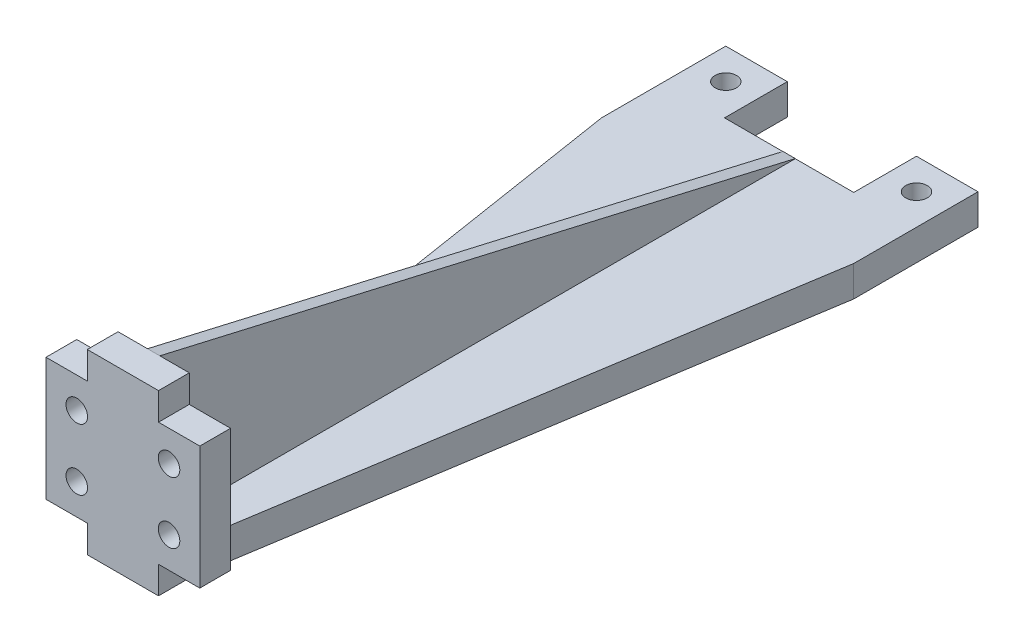
ISO-10303-21;
HEADER;
FILE_DESCRIPTION(('STEP AP214'),'2;1');
FILE_NAME('part.step','',(''),(''),'','','');
FILE_SCHEMA(('AUTOMOTIVE_DESIGN { 1 0 10303 214 1 1 1 1 }'));
ENDSEC;
DATA;
#1=APPLICATION_CONTEXT('core data for automotive mechanical design processes');
#2=APPLICATION_PROTOCOL_DEFINITION('international standard','automotive_design',2000,#1);
#3=PRODUCT_CONTEXT('',#1,'mechanical');
#4=PRODUCT('Part','Part','',(#3));
#5=PRODUCT_RELATED_PRODUCT_CATEGORY('part','',(#4));
#6=PRODUCT_DEFINITION_FORMATION('','',#4);
#7=PRODUCT_DEFINITION_CONTEXT('part definition',#1,'design');
#8=PRODUCT_DEFINITION('design','',#6,#7);
#9=PRODUCT_DEFINITION_SHAPE('','',#8);
#10=(LENGTH_UNIT() NAMED_UNIT(*) SI_UNIT(.MILLI.,.METRE.));
#11=(NAMED_UNIT(*) PLANE_ANGLE_UNIT() SI_UNIT($,.RADIAN.));
#12=(NAMED_UNIT(*) SI_UNIT($,.STERADIAN.) SOLID_ANGLE_UNIT());
#13=UNCERTAINTY_MEASURE_WITH_UNIT(LENGTH_MEASURE(1.E-05),#10,'distance_accuracy_value','');
#14=(GEOMETRIC_REPRESENTATION_CONTEXT(3) GLOBAL_UNCERTAINTY_ASSIGNED_CONTEXT((#13)) GLOBAL_UNIT_ASSIGNED_CONTEXT((#10,
#11,#12)) REPRESENTATION_CONTEXT('',''));
#15=CARTESIAN_POINT('',(0.,0.,0.));
#16=DIRECTION('',(0.,0.,1.));
#17=DIRECTION('',(1.,0.,0.));
#18=AXIS2_PLACEMENT_3D('',#15,#16,#17);
#19=CARTESIAN_POINT('',(25.5,0.,0.));
#20=DIRECTION('',(-0.987795534416173,0.,-0.155756162598684));
#21=DIRECTION('',(-0.155756162598684,0.,0.987795534416173));
#22=AXIS2_PLACEMENT_3D('',#19,#20,#21);
#23=PLANE('',#22);
#24=DIRECTION('',(0.,1.,0.));
#25=VECTOR('',#24,1.);
#26=CARTESIAN_POINT('',(26.2884028484232,-9.01387818865998,-5.));
#27=LINE('',#26,#25);
#28=CARTESIAN_POINT('',(26.2884028484232,0.,-5.));
#29=VERTEX_POINT('',#28);
#30=CARTESIAN_POINT('',(26.2884028484232,4.45,-5.));
#31=VERTEX_POINT('',#30);
#32=EDGE_CURVE('E293',#29,#31,#27,.T.);
#33=ORIENTED_EDGE('',*,*,#32,.F.);
#34=DIRECTION('',(-0.155756162598684,0.,0.987795534416173));
#35=VECTOR('',#34,1.);
#36=CARTESIAN_POINT('',(25.5,0.,0.));
#37=LINE('',#36,#35);
#38=CARTESIAN_POINT('',(41.,0.,-98.3));
#39=VERTEX_POINT('',#38);
#40=EDGE_CURVE('E343',#39,#29,#37,.T.);
#41=ORIENTED_EDGE('',*,*,#40,.F.);
#42=DIRECTION('',(0.,1.,0.));
#43=VECTOR('',#42,1.);
#44=CARTESIAN_POINT('',(41.,0.,-98.3));
#45=LINE('',#44,#43);
#46=CARTESIAN_POINT('',(41.,5.,-98.3));
#47=VERTEX_POINT('',#46);
#48=EDGE_CURVE('E339',#39,#47,#45,.T.);
#49=ORIENTED_EDGE('',*,*,#48,.T.);
#50=DIRECTION('',(-0.155756162598684,0.,0.987795534416173));
#51=VECTOR('',#50,1.);
#52=CARTESIAN_POINT('',(25.5,5.,0.));
#53=LINE('',#52,#51);
#54=CARTESIAN_POINT('',(26.2884028484232,5.,-5.));
#55=VERTEX_POINT('',#54);
#56=EDGE_CURVE('E330',#47,#55,#53,.T.);
#57=ORIENTED_EDGE('',*,*,#56,.T.);
#58=EDGE_CURVE('E297',#31,#55,#27,.T.);
#59=ORIENTED_EDGE('',*,*,#58,.F.);
#60=EDGE_LOOP('',(#33,#41,#49,#57,#59));
#61=FACE_BOUND('',#60,.T.);
#62=ADVANCED_FACE('F39',(#61),#23,.F.);
#63=CARTESIAN_POINT('',(0.,5.,0.));
#64=DIRECTION('',(0.,-1.,0.));
#65=DIRECTION('',(0.,0.,-1.));
#66=AXIS2_PLACEMENT_3D('',#63,#64,#65);
#67=PLANE('',#66);
#68=DIRECTION('',(0.,0.,-1.));
#69=VECTOR('',#68,1.);
#70=CARTESIAN_POINT('',(41.,5.,0.));
#71=LINE('',#70,#69);
#72=CARTESIAN_POINT('',(41.,5.,-118.5));
#73=VERTEX_POINT('',#72);
#74=EDGE_CURVE('E392',#47,#73,#71,.T.);
#75=ORIENTED_EDGE('',*,*,#74,.T.);
#76=DIRECTION('',(-1.,0.,0.));
#77=VECTOR('',#76,1.);
#78=CARTESIAN_POINT('',(0.,5.,-118.5));
#79=LINE('',#78,#77);
#80=CARTESIAN_POINT('',(31.,5.,-118.5));
#81=VERTEX_POINT('',#80);
#82=EDGE_CURVE('E396',#73,#81,#79,.T.);
#83=ORIENTED_EDGE('',*,*,#82,.T.);
#84=DIRECTION('',(0.,0.,-1.));
#85=VECTOR('',#84,1.);
#86=CARTESIAN_POINT('',(31.,5.,-118.5));
#87=LINE('',#86,#85);
#88=CARTESIAN_POINT('',(31.,5.,-108.3));
#89=VERTEX_POINT('',#88);
#90=EDGE_CURVE('E375',#89,#81,#87,.T.);
#91=ORIENTED_EDGE('',*,*,#90,.F.);
#92=DIRECTION('',(1.,0.,0.));
#93=VECTOR('',#92,1.);
#94=CARTESIAN_POINT('',(10.,5.,-108.3));
#95=LINE('',#94,#93);
#96=CARTESIAN_POINT('',(21.5,5.,-108.3));
#97=VERTEX_POINT('',#96);
#98=EDGE_CURVE('E352',#97,#89,#95,.T.);
#99=ORIENTED_EDGE('',*,*,#98,.F.);
#100=DIRECTION('',(0.,0.,-1.));
#101=VECTOR('',#100,1.);
#102=CARTESIAN_POINT('',(21.5,5.,-108.3));
#103=LINE('',#102,#101);
#104=CARTESIAN_POINT('',(21.5,5.,-5.));
#105=VERTEX_POINT('',#104);
#106=EDGE_CURVE('E312',#105,#97,#103,.T.);
#107=ORIENTED_EDGE('',*,*,#106,.F.);
#108=DIRECTION('',(-1.,0.,0.));
#109=VECTOR('',#108,1.);
#110=CARTESIAN_POINT('',(14.7115971515768,5.,-5.));
#111=LINE('',#110,#109);
#112=EDGE_CURVE('E331',#55,#105,#111,.T.);
#113=ORIENTED_EDGE('',*,*,#112,.F.);
#114=ORIENTED_EDGE('',*,*,#56,.F.);
#115=EDGE_LOOP('',(#75,#83,#91,#99,#107,#113,#114));
#116=FACE_BOUND('',#115,.T.);
#117=CARTESIAN_POINT('',(36.,5.,-113.5));
#118=DIRECTION('',(0.,1.,0.));
#119=DIRECTION('',(0.,0.,1.));
#120=AXIS2_PLACEMENT_3D('',#117,#118,#119);
#121=CIRCLE('',#120,1.75);
#122=CARTESIAN_POINT('',(36.,5.,-111.75));
#123=VERTEX_POINT('',#122);
#124=EDGE_CURVE('E342',#123,#123,#121,.T.);
#125=ORIENTED_EDGE('',*,*,#124,.F.);
#126=EDGE_LOOP('',(#125));
#127=FACE_BOUND('',#126,.T.);
#128=ADVANCED_FACE('F430',(#116,#127),#67,.F.);
#129=CARTESIAN_POINT('',(5.,5.,-113.5));
#130=DIRECTION('',(0.,1.,0.));
#131=DIRECTION('',(0.,0.,1.));
#132=AXIS2_PLACEMENT_3D('',#129,#130,#131);
#133=CIRCLE('',#132,1.75);
#134=CARTESIAN_POINT('',(5.,5.,-111.75));
#135=VERTEX_POINT('',#134);
#136=EDGE_CURVE('E353',#135,#135,#133,.T.);
#137=ORIENTED_EDGE('',*,*,#136,.F.);
#138=EDGE_LOOP('',(#137));
#139=FACE_BOUND('',#138,.T.);
#140=DIRECTION('',(0.,0.,1.));
#141=VECTOR('',#140,1.);
#142=CARTESIAN_POINT('',(19.5,5.,-108.3));
#143=LINE('',#142,#141);
#144=CARTESIAN_POINT('',(19.5,5.,-108.3));
#145=VERTEX_POINT('',#144);
#146=CARTESIAN_POINT('',(19.5,5.,-5.));
#147=VERTEX_POINT('',#146);
#148=EDGE_CURVE('E310',#145,#147,#143,.T.);
#149=ORIENTED_EDGE('',*,*,#148,.F.);
#150=CARTESIAN_POINT('',(10.,5.,-108.3));
#151=VERTEX_POINT('',#150);
#152=EDGE_CURVE('E372',#151,#145,#95,.T.);
#153=ORIENTED_EDGE('',*,*,#152,.F.);
#154=DIRECTION('',(0.,0.,1.));
#155=VECTOR('',#154,1.);
#156=CARTESIAN_POINT('',(10.,5.,-118.5));
#157=LINE('',#156,#155);
#158=CARTESIAN_POINT('',(10.,5.,-118.5));
#159=VERTEX_POINT('',#158);
#160=EDGE_CURVE('E365',#159,#151,#157,.T.);
#161=ORIENTED_EDGE('',*,*,#160,.F.);
#162=CARTESIAN_POINT('',(0.,5.,-118.5));
#163=VERTEX_POINT('',#162);
#164=EDGE_CURVE('E395',#159,#163,#79,.T.);
#165=ORIENTED_EDGE('',*,*,#164,.T.);
#166=DIRECTION('',(0.,0.,1.));
#167=VECTOR('',#166,1.);
#168=CARTESIAN_POINT('',(0.,5.,0.));
#169=LINE('',#168,#167);
#170=CARTESIAN_POINT('',(0.,5.,-98.3));
#171=VERTEX_POINT('',#170);
#172=EDGE_CURVE('E389',#163,#171,#169,.T.);
#173=ORIENTED_EDGE('',*,*,#172,.T.);
#174=DIRECTION('',(-0.155756162598685,0.,-0.987795534416173));
#175=VECTOR('',#174,1.);
#176=CARTESIAN_POINT('',(15.5,5.,0.));
#177=LINE('',#176,#175);
#178=CARTESIAN_POINT('',(14.7115971515768,5.,-5.));
#179=VERTEX_POINT('',#178);
#180=EDGE_CURVE('E337',#179,#171,#177,.T.);
#181=ORIENTED_EDGE('',*,*,#180,.F.);
#182=EDGE_CURVE('E324',#147,#179,#111,.T.);
#183=ORIENTED_EDGE('',*,*,#182,.F.);
#184=EDGE_LOOP('',(#149,#153,#161,#165,#173,#181,#183));
#185=FACE_BOUND('',#184,.T.);
#186=ADVANCED_FACE('F466',(#139,#185),#67,.F.);
#187=CARTESIAN_POINT('',(14.7115971515768,28.9,-5.));
#188=DIRECTION('',(0.,0.,1.));
#189=DIRECTION('',(1.,0.,0.));
#190=AXIS2_PLACEMENT_3D('',#187,#188,#189);
#191=PLANE('',#190);
#192=CARTESIAN_POINT('',(28.,19.45,-5.));
#193=DIRECTION('',(0.,0.,1.));
#194=DIRECTION('',(1.,0.,0.));
#195=AXIS2_PLACEMENT_3D('',#192,#193,#194);
#196=CIRCLE('',#195,1.75);
#197=CARTESIAN_POINT('',(29.75,19.45,-5.));
#198=VERTEX_POINT('',#197);
#199=EDGE_CURVE('E232',#198,#198,#196,.T.);
#200=ORIENTED_EDGE('',*,*,#199,.T.);
#201=EDGE_LOOP('',(#200));
#202=FACE_BOUND('',#201,.T.);
#203=CARTESIAN_POINT('',(28.,9.45,-5.));
#204=DIRECTION('',(0.,0.,1.));
#205=DIRECTION('',(1.,0.,0.));
#206=AXIS2_PLACEMENT_3D('',#203,#204,#205);
#207=CIRCLE('',#206,1.75);
#208=CARTESIAN_POINT('',(29.75,9.45,-5.));
#209=VERTEX_POINT('',#208);
#210=EDGE_CURVE('E547',#209,#209,#207,.T.);
#211=ORIENTED_EDGE('',*,*,#210,.T.);
#212=EDGE_LOOP('',(#211));
#213=FACE_BOUND('',#212,.T.);
#214=DIRECTION('',(0.,1.,0.));
#215=VECTOR('',#214,1.);
#216=CARTESIAN_POINT('',(33.,-9.01387818865998,-5.));
#217=LINE('',#216,#215);
#218=CARTESIAN_POINT('',(33.,4.45,-5.));
#219=VERTEX_POINT('',#218);
#220=CARTESIAN_POINT('',(33.,24.45,-5.));
#221=VERTEX_POINT('',#220);
#222=EDGE_CURVE('E298',#219,#221,#217,.T.);
#223=ORIENTED_EDGE('',*,*,#222,.F.);
#224=DIRECTION('',(1.,0.,0.));
#225=VECTOR('',#224,1.);
#226=CARTESIAN_POINT('',(26.2884028484232,4.45,-5.));
#227=LINE('',#226,#225);
#228=EDGE_CURVE('E54',#31,#219,#227,.T.);
#229=ORIENTED_EDGE('',*,*,#228,.F.);
#230=ORIENTED_EDGE('',*,*,#58,.T.);
#231=ORIENTED_EDGE('',*,*,#112,.T.);
#232=DIRECTION('',(0.,-1.,0.));
#233=VECTOR('',#232,1.);
#234=CARTESIAN_POINT('',(21.5,132.219359270177,-5.));
#235=LINE('',#234,#233);
#236=CARTESIAN_POINT('',(21.5,28.9,-5.));
#237=VERTEX_POINT('',#236);
#238=EDGE_CURVE('E319',#237,#105,#235,.T.);
#239=ORIENTED_EDGE('',*,*,#238,.F.);
#240=DIRECTION('',(-1.,0.,0.));
#241=VECTOR('',#240,1.);
#242=CARTESIAN_POINT('',(14.7115971515768,28.9,-5.));
#243=LINE('',#242,#241);
#244=CARTESIAN_POINT('',(26.2884028484232,28.9,-5.));
#245=VERTEX_POINT('',#244);
#246=EDGE_CURVE('E325',#245,#237,#243,.T.);
#247=ORIENTED_EDGE('',*,*,#246,.F.);
#248=DIRECTION('',(0.,1.,0.));
#249=VECTOR('',#248,1.);
#250=CARTESIAN_POINT('',(26.2884028484232,28.9,-5.));
#251=LINE('',#250,#249);
#252=CARTESIAN_POINT('',(26.2884028484232,24.45,-5.));
#253=VERTEX_POINT('',#252);
#254=EDGE_CURVE('E228',#253,#245,#251,.T.);
#255=ORIENTED_EDGE('',*,*,#254,.F.);
#256=DIRECTION('',(-1.,0.,0.));
#257=VECTOR('',#256,1.);
#258=CARTESIAN_POINT('',(33.,24.45,-5.));
#259=LINE('',#258,#257);
#260=EDGE_CURVE('E208',#221,#253,#259,.T.);
#261=ORIENTED_EDGE('',*,*,#260,.F.);
#262=EDGE_LOOP('',(#223,#229,#230,#231,#239,#247,#255,#261));
#263=FACE_BOUND('',#262,.T.);
#264=ADVANCED_FACE('F477',(#202,#213,#263),#191,.F.);
#265=CARTESIAN_POINT('',(13.,9.45,-5.));
#266=DIRECTION('',(0.,0.,1.));
#267=DIRECTION('',(1.,0.,0.));
#268=AXIS2_PLACEMENT_3D('',#265,#266,#267);
#269=CIRCLE('',#268,1.75);
#270=CARTESIAN_POINT('',(14.75,9.45,-5.));
#271=VERTEX_POINT('',#270);
#272=EDGE_CURVE('E553',#271,#271,#269,.T.);
#273=ORIENTED_EDGE('',*,*,#272,.T.);
#274=EDGE_LOOP('',(#273));
#275=FACE_BOUND('',#274,.T.);
#276=CARTESIAN_POINT('',(13.,19.45,-5.));
#277=DIRECTION('',(0.,0.,1.));
#278=DIRECTION('',(1.,0.,0.));
#279=AXIS2_PLACEMENT_3D('',#276,#277,#278);
#280=CIRCLE('',#279,1.75);
#281=CARTESIAN_POINT('',(14.75,19.45,-5.));
#282=VERTEX_POINT('',#281);
#283=EDGE_CURVE('E544',#282,#282,#280,.T.);
#284=ORIENTED_EDGE('',*,*,#283,.T.);
#285=EDGE_LOOP('',(#284));
#286=FACE_BOUND('',#285,.T.);
#287=DIRECTION('',(0.,1.,0.));
#288=VECTOR('',#287,1.);
#289=CARTESIAN_POINT('',(8.00000000000001,-9.01387818865998,-5.));
#290=LINE('',#289,#288);
#291=CARTESIAN_POINT('',(8.00000000000001,4.45,-5.));
#292=VERTEX_POINT('',#291);
#293=CARTESIAN_POINT('',(8.00000000000001,24.45,-5.));
#294=VERTEX_POINT('',#293);
#295=EDGE_CURVE('E280',#292,#294,#290,.T.);
#296=ORIENTED_EDGE('',*,*,#295,.T.);
#297=DIRECTION('',(-1.,0.,0.));
#298=VECTOR('',#297,1.);
#299=CARTESIAN_POINT('',(8.00000000000001,24.45,-5.));
#300=LINE('',#299,#298);
#301=CARTESIAN_POINT('',(14.7115971515768,24.45,-5.));
#302=VERTEX_POINT('',#301);
#303=EDGE_CURVE('E256',#302,#294,#300,.T.);
#304=ORIENTED_EDGE('',*,*,#303,.F.);
#305=DIRECTION('',(0.,-1.,0.));
#306=VECTOR('',#305,1.);
#307=CARTESIAN_POINT('',(14.7115971515768,28.9,-5.));
#308=LINE('',#307,#306);
#309=CARTESIAN_POINT('',(14.7115971515768,28.9,-5.));
#310=VERTEX_POINT('',#309);
#311=EDGE_CURVE('E236',#310,#302,#308,.T.);
#312=ORIENTED_EDGE('',*,*,#311,.F.);
#313=CARTESIAN_POINT('',(19.5,28.9,-5.));
#314=VERTEX_POINT('',#313);
#315=EDGE_CURVE('E328',#314,#310,#243,.T.);
#316=ORIENTED_EDGE('',*,*,#315,.F.);
#317=DIRECTION('',(0.,-1.,0.));
#318=VECTOR('',#317,1.);
#319=CARTESIAN_POINT('',(19.5,132.219359270177,-5.));
#320=LINE('',#319,#318);
#321=EDGE_CURVE('E321',#314,#147,#320,.T.);
#322=ORIENTED_EDGE('',*,*,#321,.T.);
#323=ORIENTED_EDGE('',*,*,#182,.T.);
#324=DIRECTION('',(0.,1.,0.));
#325=VECTOR('',#324,1.);
#326=CARTESIAN_POINT('',(14.7115971515768,-9.01387818865998,-5.));
#327=LINE('',#326,#325);
#328=CARTESIAN_POINT('',(14.7115971515768,4.45,-5.));
#329=VERTEX_POINT('',#328);
#330=EDGE_CURVE('E287',#329,#179,#327,.T.);
#331=ORIENTED_EDGE('',*,*,#330,.F.);
#332=DIRECTION('',(1.,0.,0.));
#333=VECTOR('',#332,1.);
#334=CARTESIAN_POINT('',(8.00000000000001,4.45,-5.));
#335=LINE('',#334,#333);
#336=EDGE_CURVE('E248',#292,#329,#335,.T.);
#337=ORIENTED_EDGE('',*,*,#336,.F.);
#338=EDGE_LOOP('',(#296,#304,#312,#316,#322,#323,#331,#337));
#339=FACE_BOUND('',#338,.T.);
#340=ADVANCED_FACE('F601',(#275,#286,#339),#191,.F.);
#341=CARTESIAN_POINT('',(0.,5.,-118.5));
#342=DIRECTION('',(0.,0.,1.));
#343=DIRECTION('',(1.,0.,0.));
#344=AXIS2_PLACEMENT_3D('',#341,#342,#343);
#345=PLANE('',#344);
#346=ORIENTED_EDGE('',*,*,#164,.F.);
#347=DIRECTION('',(0.,1.,0.));
#348=VECTOR('',#347,1.);
#349=CARTESIAN_POINT('',(10.,0.,-118.5));
#350=LINE('',#349,#348);
#351=CARTESIAN_POINT('',(10.,0.,-118.5));
#352=VERTEX_POINT('',#351);
#353=EDGE_CURVE('E382',#352,#159,#350,.T.);
#354=ORIENTED_EDGE('',*,*,#353,.F.);
#355=DIRECTION('',(-1.,0.,0.));
#356=VECTOR('',#355,1.);
#357=CARTESIAN_POINT('',(0.,0.,-118.5));
#358=LINE('',#357,#356);
#359=CARTESIAN_POINT('',(0.,0.,-118.5));
#360=VERTEX_POINT('',#359);
#361=EDGE_CURVE('E407',#352,#360,#358,.T.);
#362=ORIENTED_EDGE('',*,*,#361,.T.);
#363=DIRECTION('',(0.,-1.,0.));
#364=VECTOR('',#363,1.);
#365=CARTESIAN_POINT('',(0.,5.,-118.5));
#366=LINE('',#365,#364);
#367=EDGE_CURVE('E399',#163,#360,#366,.T.);
#368=ORIENTED_EDGE('',*,*,#367,.F.);
#369=EDGE_LOOP('',(#346,#354,#362,#368));
#370=FACE_BOUND('',#369,.T.);
#371=ADVANCED_FACE('F459',(#370),#345,.F.);
#372=CARTESIAN_POINT('',(0.,5.,0.));
#373=DIRECTION('',(1.,0.,0.));
#374=DIRECTION('',(0.,0.,-1.));
#375=AXIS2_PLACEMENT_3D('',#372,#373,#374);
#376=PLANE('',#375);
#377=DIRECTION('',(0.,0.,1.));
#378=VECTOR('',#377,1.);
#379=CARTESIAN_POINT('',(0.,0.,0.));
#380=LINE('',#379,#378);
#381=CARTESIAN_POINT('',(0.,0.,-98.3));
#382=VERTEX_POINT('',#381);
#383=EDGE_CURVE('E381',#360,#382,#380,.T.);
#384=ORIENTED_EDGE('',*,*,#383,.T.);
#385=DIRECTION('',(0.,1.,0.));
#386=VECTOR('',#385,1.);
#387=CARTESIAN_POINT('',(0.,0.,-98.3));
#388=LINE('',#387,#386);
#389=EDGE_CURVE('E336',#382,#171,#388,.T.);
#390=ORIENTED_EDGE('',*,*,#389,.T.);
#391=ORIENTED_EDGE('',*,*,#172,.F.);
#392=ORIENTED_EDGE('',*,*,#367,.T.);
#393=EDGE_LOOP('',(#384,#390,#391,#392));
#394=FACE_BOUND('',#393,.T.);
#395=ADVANCED_FACE('F41',(#394),#376,.F.);
#396=CARTESIAN_POINT('',(0.,5.,0.));
#397=DIRECTION('',(0.,0.,-1.));
#398=DIRECTION('',(-1.,0.,0.));
#399=AXIS2_PLACEMENT_3D('',#396,#397,#398);
#400=PLANE('',#399);
#401=CARTESIAN_POINT('',(28.,19.45,0.));
#402=DIRECTION('',(0.,0.,1.));
#403=DIRECTION('',(1.,0.,0.));
#404=AXIS2_PLACEMENT_3D('',#401,#402,#403);
#405=CIRCLE('',#404,1.75);
#406=CARTESIAN_POINT('',(29.75,19.45,0.));
#407=VERTEX_POINT('',#406);
#408=EDGE_CURVE('E532',#407,#407,#405,.T.);
#409=ORIENTED_EDGE('',*,*,#408,.F.);
#410=EDGE_LOOP('',(#409));
#411=FACE_BOUND('',#410,.T.);
#412=CARTESIAN_POINT('',(13.,9.45,0.));
#413=DIRECTION('',(0.,0.,1.));
#414=DIRECTION('',(1.,0.,0.));
#415=AXIS2_PLACEMENT_3D('',#412,#413,#414);
#416=CIRCLE('',#415,1.75);
#417=CARTESIAN_POINT('',(14.75,9.45,0.));
#418=VERTEX_POINT('',#417);
#419=EDGE_CURVE('E536',#418,#418,#416,.T.);
#420=ORIENTED_EDGE('',*,*,#419,.F.);
#421=EDGE_LOOP('',(#420));
#422=FACE_BOUND('',#421,.T.);
#423=CARTESIAN_POINT('',(28.,9.45,0.));
#424=DIRECTION('',(0.,0.,1.));
#425=DIRECTION('',(1.,0.,0.));
#426=AXIS2_PLACEMENT_3D('',#423,#424,#425);
#427=CIRCLE('',#426,1.75);
#428=CARTESIAN_POINT('',(29.75,9.45,0.));
#429=VERTEX_POINT('',#428);
#430=EDGE_CURVE('E540',#429,#429,#427,.T.);
#431=ORIENTED_EDGE('',*,*,#430,.F.);
#432=EDGE_LOOP('',(#431));
#433=FACE_BOUND('',#432,.T.);
#434=CARTESIAN_POINT('',(13.,19.45,0.));
#435=DIRECTION('',(0.,0.,1.));
#436=DIRECTION('',(1.,0.,0.));
#437=AXIS2_PLACEMENT_3D('',#434,#435,#436);
#438=CIRCLE('',#437,1.75);
#439=CARTESIAN_POINT('',(14.75,19.45,0.));
#440=VERTEX_POINT('',#439);
#441=EDGE_CURVE('E543',#440,#440,#438,.T.);
#442=ORIENTED_EDGE('',*,*,#441,.F.);
#443=EDGE_LOOP('',(#442));
#444=FACE_BOUND('',#443,.T.);
#445=DIRECTION('',(0.,1.,0.));
#446=VECTOR('',#445,1.);
#447=CARTESIAN_POINT('',(26.2884028484232,0.,0.));
#448=LINE('',#447,#446);
#449=CARTESIAN_POINT('',(26.2884028484232,0.,0.));
#450=VERTEX_POINT('',#449);
#451=CARTESIAN_POINT('',(26.2884028484232,4.45,0.));
#452=VERTEX_POINT('',#451);
#453=EDGE_CURVE('E239',#450,#452,#448,.T.);
#454=ORIENTED_EDGE('',*,*,#453,.T.);
#455=DIRECTION('',(1.,0.,0.));
#456=VECTOR('',#455,1.);
#457=CARTESIAN_POINT('',(26.2884028484232,4.45,0.));
#458=LINE('',#457,#456);
#459=CARTESIAN_POINT('',(33.,4.45,0.));
#460=VERTEX_POINT('',#459);
#461=EDGE_CURVE('E241',#452,#460,#458,.T.);
#462=ORIENTED_EDGE('',*,*,#461,.T.);
#463=DIRECTION('',(0.,1.,0.));
#464=VECTOR('',#463,1.);
#465=CARTESIAN_POINT('',(33.,-9.01387818865998,0.));
#466=LINE('',#465,#464);
#467=CARTESIAN_POINT('',(33.,24.45,0.));
#468=VERTEX_POINT('',#467);
#469=EDGE_CURVE('E227',#460,#468,#466,.T.);
#470=ORIENTED_EDGE('',*,*,#469,.T.);
#471=DIRECTION('',(-1.,0.,0.));
#472=VECTOR('',#471,1.);
#473=CARTESIAN_POINT('',(33.,24.45,0.));
#474=LINE('',#473,#472);
#475=CARTESIAN_POINT('',(26.2884028484232,24.45,0.));
#476=VERTEX_POINT('',#475);
#477=EDGE_CURVE('E62',#468,#476,#474,.T.);
#478=ORIENTED_EDGE('',*,*,#477,.T.);
#479=DIRECTION('',(0.,1.,0.));
#480=VECTOR('',#479,1.);
#481=CARTESIAN_POINT('',(26.2884028484232,28.9,0.));
#482=LINE('',#481,#480);
#483=CARTESIAN_POINT('',(26.2884028484232,28.9,0.));
#484=VERTEX_POINT('',#483);
#485=EDGE_CURVE('E215',#476,#484,#482,.T.);
#486=ORIENTED_EDGE('',*,*,#485,.T.);
#487=DIRECTION('',(1.,0.,0.));
#488=VECTOR('',#487,1.);
#489=CARTESIAN_POINT('',(25.5,28.9,0.));
#490=LINE('',#489,#488);
#491=CARTESIAN_POINT('',(14.7115971515768,28.9,0.));
#492=VERTEX_POINT('',#491);
#493=EDGE_CURVE('E327',#492,#484,#490,.T.);
#494=ORIENTED_EDGE('',*,*,#493,.F.);
#495=DIRECTION('',(0.,-1.,0.));
#496=VECTOR('',#495,1.);
#497=CARTESIAN_POINT('',(14.7115971515768,28.9,0.));
#498=LINE('',#497,#496);
#499=CARTESIAN_POINT('',(14.7115971515768,24.45,0.));
#500=VERTEX_POINT('',#499);
#501=EDGE_CURVE('E252',#492,#500,#498,.T.);
#502=ORIENTED_EDGE('',*,*,#501,.T.);
#503=DIRECTION('',(-1.,0.,0.));
#504=VECTOR('',#503,1.);
#505=CARTESIAN_POINT('',(8.00000000000001,24.45,0.));
#506=LINE('',#505,#504);
#507=CARTESIAN_POINT('',(8.00000000000001,24.45,0.));
#508=VERTEX_POINT('',#507);
#509=EDGE_CURVE('E255',#500,#508,#506,.T.);
#510=ORIENTED_EDGE('',*,*,#509,.T.);
#511=DIRECTION('',(0.,1.,0.));
#512=VECTOR('',#511,1.);
#513=CARTESIAN_POINT('',(8.00000000000001,-9.01387818865998,0.));
#514=LINE('',#513,#512);
#515=CARTESIAN_POINT('',(8.00000000000001,4.45,0.));
#516=VERTEX_POINT('',#515);
#517=EDGE_CURVE('E284',#516,#508,#514,.T.);
#518=ORIENTED_EDGE('',*,*,#517,.F.);
#519=DIRECTION('',(1.,0.,0.));
#520=VECTOR('',#519,1.);
#521=CARTESIAN_POINT('',(8.00000000000001,4.45,0.));
#522=LINE('',#521,#520);
#523=CARTESIAN_POINT('',(14.7115971515768,4.45,0.));
#524=VERTEX_POINT('',#523);
#525=EDGE_CURVE('E268',#516,#524,#522,.T.);
#526=ORIENTED_EDGE('',*,*,#525,.T.);
#527=DIRECTION('',(0.,-1.,0.));
#528=VECTOR('',#527,1.);
#529=CARTESIAN_POINT('',(14.7115971515768,4.45,0.));
#530=LINE('',#529,#528);
#531=CARTESIAN_POINT('',(14.7115971515768,0.,0.));
#532=VERTEX_POINT('',#531);
#533=EDGE_CURVE('E271',#524,#532,#530,.T.);
#534=ORIENTED_EDGE('',*,*,#533,.T.);
#535=DIRECTION('',(1.,0.,0.));
#536=VECTOR('',#535,1.);
#537=CARTESIAN_POINT('',(0.,0.,0.));
#538=LINE('',#537,#536);
#539=EDGE_CURVE('E402',#532,#450,#538,.T.);
#540=ORIENTED_EDGE('',*,*,#539,.T.);
#541=EDGE_LOOP('',(#454,#462,#470,#478,#486,#494,#502,#510,#518,#526,#534,#540));
#542=FACE_BOUND('',#541,.T.);
#543=ADVANCED_FACE('F224',(#411,#422,#433,#444,#542),#400,.F.);
#544=CARTESIAN_POINT('',(41.,5.,0.));
#545=DIRECTION('',(-1.,0.,0.));
#546=DIRECTION('',(0.,0.,1.));
#547=AXIS2_PLACEMENT_3D('',#544,#545,#546);
#548=PLANE('',#547);
#549=ORIENTED_EDGE('',*,*,#74,.F.);
#550=ORIENTED_EDGE('',*,*,#48,.F.);
#551=DIRECTION('',(0.,0.,-1.));
#552=VECTOR('',#551,1.);
#553=CARTESIAN_POINT('',(41.,0.,0.));
#554=LINE('',#553,#552);
#555=CARTESIAN_POINT('',(41.,0.,-118.5));
#556=VERTEX_POINT('',#555);
#557=EDGE_CURVE('E405',#39,#556,#554,.T.);
#558=ORIENTED_EDGE('',*,*,#557,.T.);
#559=DIRECTION('',(0.,-1.,0.));
#560=VECTOR('',#559,1.);
#561=CARTESIAN_POINT('',(41.,5.,-118.5));
#562=LINE('',#561,#560);
#563=EDGE_CURVE('E47',#73,#556,#562,.T.);
#564=ORIENTED_EDGE('',*,*,#563,.F.);
#565=EDGE_LOOP('',(#549,#550,#558,#564));
#566=FACE_BOUND('',#565,.T.);
#567=ADVANCED_FACE('F436',(#566),#548,.F.);
#568=CARTESIAN_POINT('',(31.,0.,-118.5));
#569=VERTEX_POINT('',#568);
#570=EDGE_CURVE('E393',#556,#569,#358,.T.);
#571=ORIENTED_EDGE('',*,*,#570,.T.);
#572=DIRECTION('',(0.,1.,0.));
#573=VECTOR('',#572,1.);
#574=CARTESIAN_POINT('',(31.,0.,-118.5));
#575=LINE('',#574,#573);
#576=EDGE_CURVE('E384',#569,#81,#575,.T.);
#577=ORIENTED_EDGE('',*,*,#576,.T.);
#578=ORIENTED_EDGE('',*,*,#82,.F.);
#579=ORIENTED_EDGE('',*,*,#563,.T.);
#580=EDGE_LOOP('',(#571,#577,#578,#579));
#581=FACE_BOUND('',#580,.T.);
#582=ADVANCED_FACE('F416',(#581),#345,.F.);
#583=CARTESIAN_POINT('',(0.,0.,0.));
#584=DIRECTION('',(0.,-1.,0.));
#585=DIRECTION('',(0.,0.,-1.));
#586=AXIS2_PLACEMENT_3D('',#583,#584,#585);
#587=PLANE('',#586);
#588=DIRECTION('',(0.,0.,-1.));
#589=VECTOR('',#588,1.);
#590=CARTESIAN_POINT('',(26.2884028484232,0.,0.));
#591=LINE('',#590,#589);
#592=EDGE_CURVE('E243',#450,#29,#591,.T.);
#593=ORIENTED_EDGE('',*,*,#592,.F.);
#594=ORIENTED_EDGE('',*,*,#539,.F.);
#595=DIRECTION('',(0.,0.,-1.));
#596=VECTOR('',#595,1.);
#597=CARTESIAN_POINT('',(14.7115971515768,0.,0.));
#598=LINE('',#597,#596);
#599=CARTESIAN_POINT('',(14.7115971515768,0.,-5.));
#600=VERTEX_POINT('',#599);
#601=EDGE_CURVE('E277',#532,#600,#598,.T.);
#602=ORIENTED_EDGE('',*,*,#601,.T.);
#603=DIRECTION('',(-0.155756162598685,0.,-0.987795534416173));
#604=VECTOR('',#603,1.);
#605=CARTESIAN_POINT('',(15.5,0.,0.));
#606=LINE('',#605,#604);
#607=EDGE_CURVE('E334',#600,#382,#606,.T.);
#608=ORIENTED_EDGE('',*,*,#607,.T.);
#609=ORIENTED_EDGE('',*,*,#383,.F.);
#610=ORIENTED_EDGE('',*,*,#361,.F.);
#611=DIRECTION('',(0.,0.,1.));
#612=VECTOR('',#611,1.);
#613=CARTESIAN_POINT('',(10.,0.,-118.5));
#614=LINE('',#613,#612);
#615=CARTESIAN_POINT('',(10.,0.,-108.3));
#616=VERTEX_POINT('',#615);
#617=EDGE_CURVE('E368',#352,#616,#614,.T.);
#618=ORIENTED_EDGE('',*,*,#617,.T.);
#619=DIRECTION('',(1.,0.,0.));
#620=VECTOR('',#619,1.);
#621=CARTESIAN_POINT('',(10.,0.,-108.3));
#622=LINE('',#621,#620);
#623=CARTESIAN_POINT('',(31.,0.,-108.3));
#624=VERTEX_POINT('',#623);
#625=EDGE_CURVE('E361',#616,#624,#622,.T.);
#626=ORIENTED_EDGE('',*,*,#625,.T.);
#627=DIRECTION('',(0.,0.,-1.));
#628=VECTOR('',#627,1.);
#629=CARTESIAN_POINT('',(31.,0.,-118.5));
#630=LINE('',#629,#628);
#631=EDGE_CURVE('E364',#624,#569,#630,.T.);
#632=ORIENTED_EDGE('',*,*,#631,.T.);
#633=ORIENTED_EDGE('',*,*,#570,.F.);
#634=ORIENTED_EDGE('',*,*,#557,.F.);
#635=ORIENTED_EDGE('',*,*,#40,.T.);
#636=EDGE_LOOP('',(#593,#594,#602,#608,#609,#610,#618,#626,#632,#633,#634,#635));
#637=FACE_BOUND('',#636,.T.);
#638=CARTESIAN_POINT('',(5.,0.,-113.5));
#639=DIRECTION('',(0.,1.,0.));
#640=DIRECTION('',(0.,0.,1.));
#641=AXIS2_PLACEMENT_3D('',#638,#639,#640);
#642=CIRCLE('',#641,1.75);
#643=CARTESIAN_POINT('',(5.,0.,-111.75));
#644=VERTEX_POINT('',#643);
#645=EDGE_CURVE('E349',#644,#644,#642,.T.);
#646=ORIENTED_EDGE('',*,*,#645,.T.);
#647=EDGE_LOOP('',(#646));
#648=FACE_BOUND('',#647,.T.);
#649=CARTESIAN_POINT('',(36.,0.,-113.5));
#650=DIRECTION('',(0.,1.,0.));
#651=DIRECTION('',(0.,0.,1.));
#652=AXIS2_PLACEMENT_3D('',#649,#650,#651);
#653=CIRCLE('',#652,1.75);
#654=CARTESIAN_POINT('',(36.,0.,-111.75));
#655=VERTEX_POINT('',#654);
#656=EDGE_CURVE('E356',#655,#655,#653,.T.);
#657=ORIENTED_EDGE('',*,*,#656,.T.);
#658=EDGE_LOOP('',(#657));
#659=FACE_BOUND('',#658,.T.);
#660=ADVANCED_FACE('F422',(#637,#648,#659),#587,.T.);
#661=CARTESIAN_POINT('',(10.,0.,-108.3));
#662=DIRECTION('',(0.,0.,1.));
#663=DIRECTION('',(1.,0.,0.));
#664=AXIS2_PLACEMENT_3D('',#661,#662,#663);
#665=PLANE('',#664);
#666=DIRECTION('',(0.,-1.,0.));
#667=VECTOR('',#666,1.);
#668=CARTESIAN_POINT('',(19.5,132.219359270177,-108.3));
#669=LINE('',#668,#667);
#670=CARTESIAN_POINT('',(19.5,5.02311411992267,-108.3));
#671=VERTEX_POINT('',#670);
#672=EDGE_CURVE('E315',#671,#145,#669,.T.);
#673=ORIENTED_EDGE('',*,*,#672,.F.);
#674=DIRECTION('',(1.,0.,0.));
#675=VECTOR('',#674,1.);
#676=CARTESIAN_POINT('',(10.,5.02311411992263,-108.3));
#677=LINE('',#676,#675);
#678=CARTESIAN_POINT('',(21.5,5.02311411992264,-108.3));
#679=VERTEX_POINT('',#678);
#680=EDGE_CURVE('E307',#671,#679,#677,.T.);
#681=ORIENTED_EDGE('',*,*,#680,.T.);
#682=DIRECTION('',(0.,-1.,0.));
#683=VECTOR('',#682,1.);
#684=CARTESIAN_POINT('',(21.5,132.219359270177,-108.3));
#685=LINE('',#684,#683);
#686=EDGE_CURVE('E317',#679,#97,#685,.T.);
#687=ORIENTED_EDGE('',*,*,#686,.T.);
#688=ORIENTED_EDGE('',*,*,#98,.T.);
#689=DIRECTION('',(0.,1.,0.));
#690=VECTOR('',#689,1.);
#691=CARTESIAN_POINT('',(31.,0.,-108.3));
#692=LINE('',#691,#690);
#693=EDGE_CURVE('E371',#624,#89,#692,.T.);
#694=ORIENTED_EDGE('',*,*,#693,.F.);
#695=ORIENTED_EDGE('',*,*,#625,.F.);
#696=DIRECTION('',(0.,1.,0.));
#697=VECTOR('',#696,1.);
#698=CARTESIAN_POINT('',(10.,0.,-108.3));
#699=LINE('',#698,#697);
#700=EDGE_CURVE('E379',#616,#151,#699,.T.);
#701=ORIENTED_EDGE('',*,*,#700,.T.);
#702=ORIENTED_EDGE('',*,*,#152,.T.);
#703=EDGE_LOOP('',(#673,#681,#687,#688,#694,#695,#701,#702));
#704=FACE_BOUND('',#703,.T.);
#705=ADVANCED_FACE('F470',(#704),#665,.F.);
#706=CARTESIAN_POINT('',(10.,0.,-118.5));
#707=DIRECTION('',(-1.,0.,0.));
#708=DIRECTION('',(0.,0.,1.));
#709=AXIS2_PLACEMENT_3D('',#706,#707,#708);
#710=PLANE('',#709);
#711=ORIENTED_EDGE('',*,*,#160,.T.);
#712=ORIENTED_EDGE('',*,*,#700,.F.);
#713=ORIENTED_EDGE('',*,*,#617,.F.);
#714=ORIENTED_EDGE('',*,*,#353,.T.);
#715=EDGE_LOOP('',(#711,#712,#713,#714));
#716=FACE_BOUND('',#715,.T.);
#717=ADVANCED_FACE('F462',(#716),#710,.F.);
#718=CARTESIAN_POINT('',(31.,0.,-118.5));
#719=DIRECTION('',(1.,0.,0.));
#720=DIRECTION('',(0.,0.,-1.));
#721=AXIS2_PLACEMENT_3D('',#718,#719,#720);
#722=PLANE('',#721);
#723=ORIENTED_EDGE('',*,*,#90,.T.);
#724=ORIENTED_EDGE('',*,*,#576,.F.);
#725=ORIENTED_EDGE('',*,*,#631,.F.);
#726=ORIENTED_EDGE('',*,*,#693,.T.);
#727=EDGE_LOOP('',(#723,#724,#725,#726));
#728=FACE_BOUND('',#727,.T.);
#729=ADVANCED_FACE('F427',(#728),#722,.F.);
#730=CARTESIAN_POINT('',(36.,0.,-113.5));
#731=DIRECTION('',(0.,1.,0.));
#732=DIRECTION('',(0.,0.,1.));
#733=AXIS2_PLACEMENT_3D('',#730,#731,#732);
#734=CYLINDRICAL_SURFACE('',#733,1.75);
#735=ORIENTED_EDGE('',*,*,#656,.F.);
#736=EDGE_LOOP('',(#735));
#737=FACE_BOUND('',#736,.T.);
#738=ORIENTED_EDGE('',*,*,#124,.T.);
#739=EDGE_LOOP('',(#738));
#740=FACE_BOUND('',#739,.T.);
#741=ADVANCED_FACE('F508',(#737,#740),#734,.F.);
#742=CARTESIAN_POINT('',(5.,0.,-113.5));
#743=DIRECTION('',(0.,1.,0.));
#744=DIRECTION('',(0.,0.,1.));
#745=AXIS2_PLACEMENT_3D('',#742,#743,#744);
#746=CYLINDRICAL_SURFACE('',#745,1.75);
#747=ORIENTED_EDGE('',*,*,#645,.F.);
#748=EDGE_LOOP('',(#747));
#749=FACE_BOUND('',#748,.T.);
#750=ORIENTED_EDGE('',*,*,#136,.T.);
#751=EDGE_LOOP('',(#750));
#752=FACE_BOUND('',#751,.T.);
#753=ADVANCED_FACE('F505',(#749,#752),#746,.F.);
#754=CARTESIAN_POINT('',(15.5,0.,0.));
#755=DIRECTION('',(0.987795534416173,0.,-0.155756162598685));
#756=DIRECTION('',(-0.155756162598685,0.,-0.987795534416173));
#757=AXIS2_PLACEMENT_3D('',#754,#755,#756);
#758=PLANE('',#757);
#759=ORIENTED_EDGE('',*,*,#607,.F.);
#760=EDGE_CURVE('E290',#600,#329,#327,.T.);
#761=ORIENTED_EDGE('',*,*,#760,.T.);
#762=ORIENTED_EDGE('',*,*,#330,.T.);
#763=ORIENTED_EDGE('',*,*,#180,.T.);
#764=ORIENTED_EDGE('',*,*,#389,.F.);
#765=EDGE_LOOP('',(#759,#761,#762,#763,#764));
#766=FACE_BOUND('',#765,.T.);
#767=ADVANCED_FACE('F450',(#766),#758,.F.);
#768=CARTESIAN_POINT('',(0.,28.9,0.));
#769=DIRECTION('',(0.,-1.,0.));
#770=DIRECTION('',(0.,0.,-1.));
#771=AXIS2_PLACEMENT_3D('',#768,#769,#770);
#772=PLANE('',#771);
#773=ORIENTED_EDGE('',*,*,#315,.T.);
#774=DIRECTION('',(0.,0.,-1.));
#775=VECTOR('',#774,1.);
#776=CARTESIAN_POINT('',(14.7115971515768,28.9,0.));
#777=LINE('',#776,#775);
#778=EDGE_CURVE('E259',#492,#310,#777,.T.);
#779=ORIENTED_EDGE('',*,*,#778,.F.);
#780=ORIENTED_EDGE('',*,*,#493,.T.);
#781=DIRECTION('',(0.,0.,-1.));
#782=VECTOR('',#781,1.);
#783=CARTESIAN_POINT('',(26.2884028484232,28.9,0.));
#784=LINE('',#783,#782);
#785=EDGE_CURVE('E211',#484,#245,#784,.T.);
#786=ORIENTED_EDGE('',*,*,#785,.T.);
#787=ORIENTED_EDGE('',*,*,#246,.T.);
#788=DIRECTION('',(-1.,0.,0.));
#789=VECTOR('',#788,1.);
#790=CARTESIAN_POINT('',(41.,28.9,-5.));
#791=LINE('',#790,#789);
#792=EDGE_CURVE('E296',#237,#314,#791,.T.);
#793=ORIENTED_EDGE('',*,*,#792,.T.);
#794=EDGE_LOOP('',(#773,#779,#780,#786,#787,#793));
#795=FACE_BOUND('',#794,.T.);
#796=ADVANCED_FACE('F666',(#795),#772,.F.);
#797=CARTESIAN_POINT('',(21.5,132.219359270177,-108.3));
#798=DIRECTION('',(-1.,0.,0.));
#799=DIRECTION('',(0.,0.,1.));
#800=AXIS2_PLACEMENT_3D('',#797,#798,#799);
#801=PLANE('',#800);
#802=ORIENTED_EDGE('',*,*,#686,.F.);
#803=DIRECTION('',(0.,0.225203581644859,0.974311729794078));
#804=VECTOR('',#803,1.);
#805=CARTESIAN_POINT('',(21.5,11.4740819717279,-80.3907918043236));
#806=LINE('',#805,#804);
#807=EDGE_CURVE('E304',#679,#237,#806,.T.);
#808=ORIENTED_EDGE('',*,*,#807,.T.);
#809=ORIENTED_EDGE('',*,*,#238,.T.);
#810=ORIENTED_EDGE('',*,*,#106,.T.);
#811=EDGE_LOOP('',(#802,#808,#809,#810));
#812=FACE_BOUND('',#811,.T.);
#813=ADVANCED_FACE('F672',(#812),#801,.F.);
#814=CARTESIAN_POINT('',(19.5,132.219359270177,-108.3));
#815=DIRECTION('',(1.,0.,0.));
#816=DIRECTION('',(0.,0.,-1.));
#817=AXIS2_PLACEMENT_3D('',#814,#815,#816);
#818=PLANE('',#817);
#819=ORIENTED_EDGE('',*,*,#321,.F.);
#820=DIRECTION('',(0.,-0.225203581644859,-0.974311729794078));
#821=VECTOR('',#820,1.);
#822=CARTESIAN_POINT('',(19.5,11.4740819717279,-80.3907918043236));
#823=LINE('',#822,#821);
#824=EDGE_CURVE('E11',#314,#671,#823,.T.);
#825=ORIENTED_EDGE('',*,*,#824,.T.);
#826=ORIENTED_EDGE('',*,*,#672,.T.);
#827=ORIENTED_EDGE('',*,*,#148,.T.);
#828=EDGE_LOOP('',(#819,#825,#826,#827));
#829=FACE_BOUND('',#828,.T.);
#830=ADVANCED_FACE('F748',(#829),#818,.F.);
#831=CARTESIAN_POINT('',(41.,5.,-108.4));
#832=DIRECTION('',(0.,-0.974311729794077,0.225203581644859));
#833=DIRECTION('',(0.,-0.225203581644859,-0.974311729794078));
#834=AXIS2_PLACEMENT_3D('',#831,#832,#833);
#835=PLANE('',#834);
#836=ORIENTED_EDGE('',*,*,#824,.F.);
#837=ORIENTED_EDGE('',*,*,#792,.F.);
#838=ORIENTED_EDGE('',*,*,#807,.F.);
#839=ORIENTED_EDGE('',*,*,#680,.F.);
#840=EDGE_LOOP('',(#836,#837,#838,#839));
#841=FACE_BOUND('',#840,.T.);
#842=ADVANCED_FACE('F691',(#841),#835,.F.);
#843=CARTESIAN_POINT('',(33.,-9.01387818865998,-5.));
#844=DIRECTION('',(1.,0.,0.));
#845=DIRECTION('',(0.,0.,-1.));
#846=AXIS2_PLACEMENT_3D('',#843,#844,#845);
#847=PLANE('',#846);
#848=DIRECTION('',(0.,0.,-1.));
#849=VECTOR('',#848,1.);
#850=CARTESIAN_POINT('',(33.,4.45,0.));
#851=LINE('',#850,#849);
#852=EDGE_CURVE('E246',#460,#219,#851,.T.);
#853=ORIENTED_EDGE('',*,*,#852,.T.);
#854=ORIENTED_EDGE('',*,*,#222,.T.);
#855=DIRECTION('',(0.,0.,-1.));
#856=VECTOR('',#855,1.);
#857=CARTESIAN_POINT('',(33.,24.45,0.));
#858=LINE('',#857,#856);
#859=EDGE_CURVE('E212',#468,#221,#858,.T.);
#860=ORIENTED_EDGE('',*,*,#859,.F.);
#861=ORIENTED_EDGE('',*,*,#469,.F.);
#862=EDGE_LOOP('',(#853,#854,#860,#861));
#863=FACE_BOUND('',#862,.T.);
#864=ADVANCED_FACE('F480',(#863),#847,.T.);
#865=CARTESIAN_POINT('',(8.00000000000001,-9.01387818865998,-5.));
#866=DIRECTION('',(-1.,0.,0.));
#867=DIRECTION('',(0.,0.,1.));
#868=AXIS2_PLACEMENT_3D('',#865,#866,#867);
#869=PLANE('',#868);
#870=DIRECTION('',(0.,0.,-1.));
#871=VECTOR('',#870,1.);
#872=CARTESIAN_POINT('',(8.00000000000001,24.45,0.));
#873=LINE('',#872,#871);
#874=EDGE_CURVE('E245',#508,#294,#873,.T.);
#875=ORIENTED_EDGE('',*,*,#874,.T.);
#876=ORIENTED_EDGE('',*,*,#295,.F.);
#877=DIRECTION('',(0.,0.,-1.));
#878=VECTOR('',#877,1.);
#879=CARTESIAN_POINT('',(8.00000000000001,4.45,0.));
#880=LINE('',#879,#878);
#881=EDGE_CURVE('E274',#516,#292,#880,.T.);
#882=ORIENTED_EDGE('',*,*,#881,.F.);
#883=ORIENTED_EDGE('',*,*,#517,.T.);
#884=EDGE_LOOP('',(#875,#876,#882,#883));
#885=FACE_BOUND('',#884,.T.);
#886=ADVANCED_FACE('F690',(#885),#869,.T.);
#887=CARTESIAN_POINT('',(14.7115971515768,4.45,0.));
#888=DIRECTION('',(1.,0.,0.));
#889=DIRECTION('',(0.,0.,-1.));
#890=AXIS2_PLACEMENT_3D('',#887,#888,#889);
#891=PLANE('',#890);
#892=ORIENTED_EDGE('',*,*,#760,.F.);
#893=ORIENTED_EDGE('',*,*,#601,.F.);
#894=ORIENTED_EDGE('',*,*,#533,.F.);
#895=DIRECTION('',(0.,0.,-1.));
#896=VECTOR('',#895,1.);
#897=CARTESIAN_POINT('',(14.7115971515768,4.45,0.));
#898=LINE('',#897,#896);
#899=EDGE_CURVE('E281',#524,#329,#898,.T.);
#900=ORIENTED_EDGE('',*,*,#899,.T.);
#901=EDGE_LOOP('',(#892,#893,#894,#900));
#902=FACE_BOUND('',#901,.T.);
#903=ADVANCED_FACE('F445',(#902),#891,.F.);
#904=CARTESIAN_POINT('',(8.00000000000001,4.45,0.));
#905=DIRECTION('',(0.,1.,0.));
#906=DIRECTION('',(-1.,0.,0.));
#907=AXIS2_PLACEMENT_3D('',#904,#905,#906);
#908=PLANE('',#907);
#909=ORIENTED_EDGE('',*,*,#336,.T.);
#910=ORIENTED_EDGE('',*,*,#899,.F.);
#911=ORIENTED_EDGE('',*,*,#525,.F.);
#912=ORIENTED_EDGE('',*,*,#881,.T.);
#913=EDGE_LOOP('',(#909,#910,#911,#912));
#914=FACE_BOUND('',#913,.T.);
#915=ADVANCED_FACE('F707',(#914),#908,.F.);
#916=CARTESIAN_POINT('',(8.00000000000001,24.45,0.));
#917=DIRECTION('',(0.,-1.,0.));
#918=DIRECTION('',(0.,0.,-1.));
#919=AXIS2_PLACEMENT_3D('',#916,#917,#918);
#920=PLANE('',#919);
#921=ORIENTED_EDGE('',*,*,#303,.T.);
#922=ORIENTED_EDGE('',*,*,#874,.F.);
#923=ORIENTED_EDGE('',*,*,#509,.F.);
#924=DIRECTION('',(0.,0.,-1.));
#925=VECTOR('',#924,1.);
#926=CARTESIAN_POINT('',(14.7115971515768,24.45,0.));
#927=LINE('',#926,#925);
#928=EDGE_CURVE('E265',#500,#302,#927,.T.);
#929=ORIENTED_EDGE('',*,*,#928,.T.);
#930=EDGE_LOOP('',(#921,#922,#923,#929));
#931=FACE_BOUND('',#930,.T.);
#932=ADVANCED_FACE('F715',(#931),#920,.F.);
#933=CARTESIAN_POINT('',(14.7115971515768,28.9,0.));
#934=DIRECTION('',(1.,0.,0.));
#935=DIRECTION('',(0.,1.,0.));
#936=AXIS2_PLACEMENT_3D('',#933,#934,#935);
#937=PLANE('',#936);
#938=ORIENTED_EDGE('',*,*,#311,.T.);
#939=ORIENTED_EDGE('',*,*,#928,.F.);
#940=ORIENTED_EDGE('',*,*,#501,.F.);
#941=ORIENTED_EDGE('',*,*,#778,.T.);
#942=EDGE_LOOP('',(#938,#939,#940,#941));
#943=FACE_BOUND('',#942,.T.);
#944=ADVANCED_FACE('F576',(#943),#937,.F.);
#945=CARTESIAN_POINT('',(26.2884028484232,28.9,0.));
#946=DIRECTION('',(-1.,0.,0.));
#947=DIRECTION('',(0.,-1.,0.));
#948=AXIS2_PLACEMENT_3D('',#945,#946,#947);
#949=PLANE('',#948);
#950=ORIENTED_EDGE('',*,*,#254,.T.);
#951=ORIENTED_EDGE('',*,*,#785,.F.);
#952=ORIENTED_EDGE('',*,*,#485,.F.);
#953=DIRECTION('',(0.,0.,-1.));
#954=VECTOR('',#953,1.);
#955=CARTESIAN_POINT('',(26.2884028484232,24.45,0.));
#956=LINE('',#955,#954);
#957=EDGE_CURVE('E204',#476,#253,#956,.T.);
#958=ORIENTED_EDGE('',*,*,#957,.T.);
#959=EDGE_LOOP('',(#950,#951,#952,#958));
#960=FACE_BOUND('',#959,.T.);
#961=ADVANCED_FACE('F216',(#960),#949,.F.);
#962=CARTESIAN_POINT('',(33.,24.45,0.));
#963=DIRECTION('',(0.,-1.,0.));
#964=DIRECTION('',(0.,0.,-1.));
#965=AXIS2_PLACEMENT_3D('',#962,#963,#964);
#966=PLANE('',#965);
#967=ORIENTED_EDGE('',*,*,#260,.T.);
#968=ORIENTED_EDGE('',*,*,#957,.F.);
#969=ORIENTED_EDGE('',*,*,#477,.F.);
#970=ORIENTED_EDGE('',*,*,#859,.T.);
#971=EDGE_LOOP('',(#967,#968,#969,#970));
#972=FACE_BOUND('',#971,.T.);
#973=ADVANCED_FACE('F206',(#972),#966,.F.);
#974=CARTESIAN_POINT('',(26.2884028484232,4.45,0.));
#975=DIRECTION('',(0.,1.,0.));
#976=DIRECTION('',(-1.,0.,0.));
#977=AXIS2_PLACEMENT_3D('',#974,#975,#976);
#978=PLANE('',#977);
#979=ORIENTED_EDGE('',*,*,#228,.T.);
#980=ORIENTED_EDGE('',*,*,#852,.F.);
#981=ORIENTED_EDGE('',*,*,#461,.F.);
#982=DIRECTION('',(0.,0.,-1.));
#983=VECTOR('',#982,1.);
#984=CARTESIAN_POINT('',(26.2884028484232,4.45,0.));
#985=LINE('',#984,#983);
#986=EDGE_CURVE('E249',#452,#31,#985,.T.);
#987=ORIENTED_EDGE('',*,*,#986,.T.);
#988=EDGE_LOOP('',(#979,#980,#981,#987));
#989=FACE_BOUND('',#988,.T.);
#990=ADVANCED_FACE('F482',(#989),#978,.F.);
#991=CARTESIAN_POINT('',(26.2884028484232,0.,0.));
#992=DIRECTION('',(-1.,0.,0.));
#993=DIRECTION('',(0.,0.,1.));
#994=AXIS2_PLACEMENT_3D('',#991,#992,#993);
#995=PLANE('',#994);
#996=ORIENTED_EDGE('',*,*,#32,.T.);
#997=ORIENTED_EDGE('',*,*,#986,.F.);
#998=ORIENTED_EDGE('',*,*,#453,.F.);
#999=ORIENTED_EDGE('',*,*,#592,.T.);
#1000=EDGE_LOOP('',(#996,#997,#998,#999));
#1001=FACE_BOUND('',#1000,.T.);
#1002=ADVANCED_FACE('F483',(#1001),#995,.F.);
#1003=CARTESIAN_POINT('',(13.,19.45,-118.5));
#1004=DIRECTION('',(0.,0.,1.));
#1005=DIRECTION('',(1.,0.,0.));
#1006=AXIS2_PLACEMENT_3D('',#1003,#1004,#1005);
#1007=CYLINDRICAL_SURFACE('',#1006,1.75);
#1008=ORIENTED_EDGE('',*,*,#441,.T.);
#1009=EDGE_LOOP('',(#1008));
#1010=FACE_BOUND('',#1009,.T.);
#1011=ORIENTED_EDGE('',*,*,#283,.F.);
#1012=EDGE_LOOP('',(#1011));
#1013=FACE_BOUND('',#1012,.T.);
#1014=ADVANCED_FACE('F485',(#1010,#1013),#1007,.F.);
#1015=CARTESIAN_POINT('',(28.,9.45,-118.5));
#1016=DIRECTION('',(0.,0.,1.));
#1017=DIRECTION('',(1.,0.,0.));
#1018=AXIS2_PLACEMENT_3D('',#1015,#1016,#1017);
#1019=CYLINDRICAL_SURFACE('',#1018,1.75);
#1020=ORIENTED_EDGE('',*,*,#430,.T.);
#1021=EDGE_LOOP('',(#1020));
#1022=FACE_BOUND('',#1021,.T.);
#1023=ORIENTED_EDGE('',*,*,#210,.F.);
#1024=EDGE_LOOP('',(#1023));
#1025=FACE_BOUND('',#1024,.T.);
#1026=ADVANCED_FACE('F491',(#1022,#1025),#1019,.F.);
#1027=CARTESIAN_POINT('',(13.,9.45,-118.5));
#1028=DIRECTION('',(0.,0.,1.));
#1029=DIRECTION('',(1.,0.,0.));
#1030=AXIS2_PLACEMENT_3D('',#1027,#1028,#1029);
#1031=CYLINDRICAL_SURFACE('',#1030,1.75);
#1032=ORIENTED_EDGE('',*,*,#419,.T.);
#1033=EDGE_LOOP('',(#1032));
#1034=FACE_BOUND('',#1033,.T.);
#1035=ORIENTED_EDGE('',*,*,#272,.F.);
#1036=EDGE_LOOP('',(#1035));
#1037=FACE_BOUND('',#1036,.T.);
#1038=ADVANCED_FACE('F564',(#1034,#1037),#1031,.F.);
#1039=CARTESIAN_POINT('',(28.,19.45,-118.5));
#1040=DIRECTION('',(0.,0.,1.));
#1041=DIRECTION('',(1.,0.,0.));
#1042=AXIS2_PLACEMENT_3D('',#1039,#1040,#1041);
#1043=CYLINDRICAL_SURFACE('',#1042,1.75);
#1044=ORIENTED_EDGE('',*,*,#408,.T.);
#1045=EDGE_LOOP('',(#1044));
#1046=FACE_BOUND('',#1045,.T.);
#1047=ORIENTED_EDGE('',*,*,#199,.F.);
#1048=EDGE_LOOP('',(#1047));
#1049=FACE_BOUND('',#1048,.T.);
#1050=ADVANCED_FACE('F562',(#1046,#1049),#1043,.F.);
#1051=CLOSED_SHELL('',(#62,#128,#186,#264,#340,#371,#395,#543,#567,#582,#660,#705,#717,#729,
#741,#753,#767,#796,#813,#830,#842,#864,#886,#903,#915,#932,#944,#961,#973,#990,#1002,#1014,
#1026,#1038,#1050));
#1052=MANIFOLD_SOLID_BREP('B2',#1051);
#1053=ADVANCED_BREP_SHAPE_REPRESENTATION('',(#18,#1052),#14);
#1054=SHAPE_DEFINITION_REPRESENTATION(#9,#1053);
ENDSEC;
END-ISO-10303-21;
